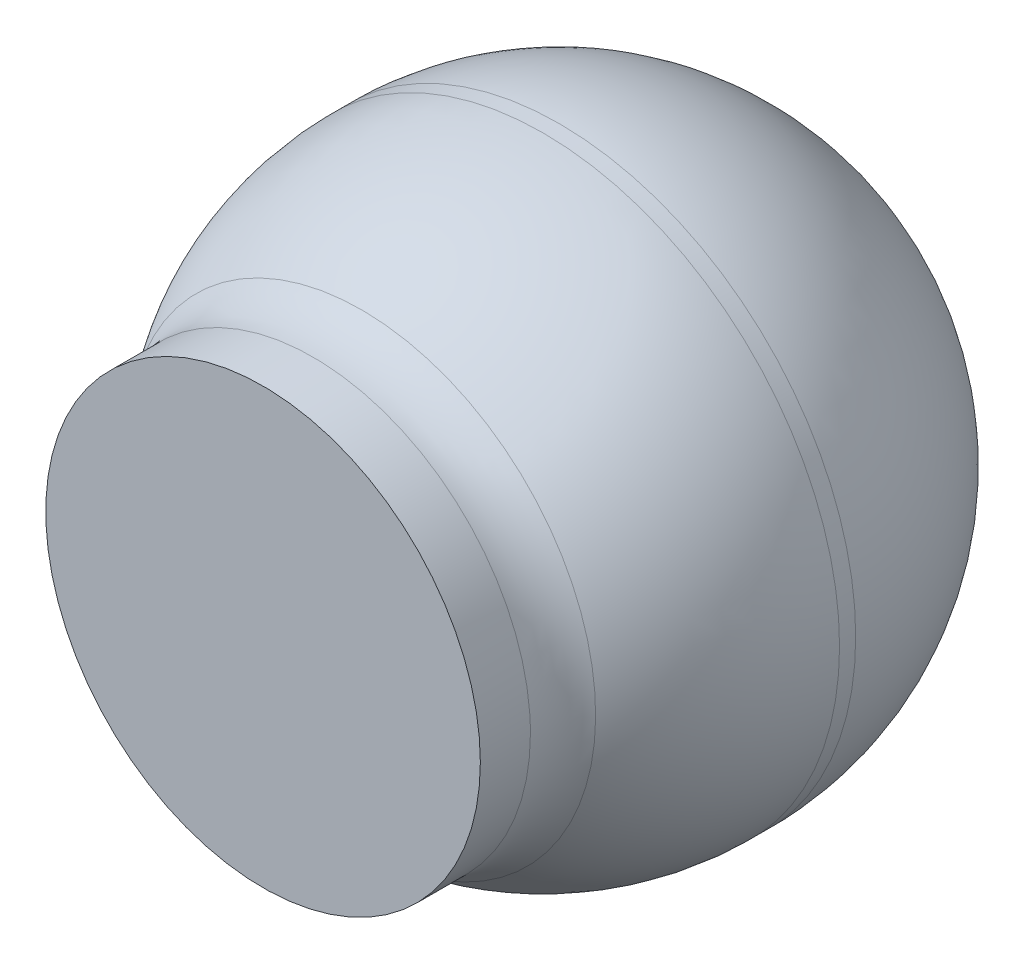
ISO-10303-21;
HEADER;
FILE_DESCRIPTION(('STEP AP214'),'2;1');
FILE_NAME('part.step','',(''),(''),'','','');
FILE_SCHEMA(('AUTOMOTIVE_DESIGN { 1 0 10303 214 1 1 1 1 }'));
ENDSEC;
DATA;
#1=APPLICATION_CONTEXT('core data for automotive mechanical design processes');
#2=APPLICATION_PROTOCOL_DEFINITION('international standard','automotive_design',2000,#1);
#3=PRODUCT_CONTEXT('',#1,'mechanical');
#4=PRODUCT('Part','Part','',(#3));
#5=PRODUCT_RELATED_PRODUCT_CATEGORY('part','',(#4));
#6=PRODUCT_DEFINITION_FORMATION('','',#4);
#7=PRODUCT_DEFINITION_CONTEXT('part definition',#1,'design');
#8=PRODUCT_DEFINITION('design','',#6,#7);
#9=PRODUCT_DEFINITION_SHAPE('','',#8);
#10=(LENGTH_UNIT() NAMED_UNIT(*) SI_UNIT(.MILLI.,.METRE.));
#11=(NAMED_UNIT(*) PLANE_ANGLE_UNIT() SI_UNIT($,.RADIAN.));
#12=(NAMED_UNIT(*) SI_UNIT($,.STERADIAN.) SOLID_ANGLE_UNIT());
#13=UNCERTAINTY_MEASURE_WITH_UNIT(LENGTH_MEASURE(1.E-05),#10,'distance_accuracy_value','');
#14=(GEOMETRIC_REPRESENTATION_CONTEXT(3) GLOBAL_UNCERTAINTY_ASSIGNED_CONTEXT((#13)) GLOBAL_UNIT_ASSIGNED_CONTEXT((#10,
#11,#12)) REPRESENTATION_CONTEXT('',''));
#15=CARTESIAN_POINT('',(0.,0.,0.));
#16=DIRECTION('',(0.,0.,1.));
#17=DIRECTION('',(1.,0.,0.));
#18=AXIS2_PLACEMENT_3D('',#15,#16,#17);
#19=CARTESIAN_POINT('',(0.707080077731,-2.781349291452,10.006534503384));
#20=DIRECTION('',(0.,0.,-1.));
#21=DIRECTION('',(-1.,0.,0.));
#22=AXIS2_PLACEMENT_3D('',#19,#20,#21);
#23=PLANE('',#22);
#24=CARTESIAN_POINT('',(0.707080077731,-2.781349291452,10.006534503384));
#25=DIRECTION('',(0.,0.,1.));
#26=DIRECTION('',(1.,0.,0.));
#27=AXIS2_PLACEMENT_3D('',#24,#25,#26);
#28=CIRCLE('',#27,0.275);
#29=CARTESIAN_POINT('',(0.982080077731,-2.781349291452,10.006534503384));
#30=VERTEX_POINT('',#29);
#31=EDGE_CURVE('E20',#30,#30,#28,.F.);
#32=ORIENTED_EDGE('',*,*,#31,.F.);
#33=EDGE_LOOP('',(#32));
#34=FACE_BOUND('',#33,.T.);
#35=ADVANCED_FACE('F17',(#34),#23,.F.);
#36=CARTESIAN_POINT('',(0.707080077731,-2.781349291452,9.906534503384));
#37=DIRECTION('',(0.,0.,1.));
#38=DIRECTION('',(1.,0.,0.));
#39=AXIS2_PLACEMENT_3D('',#36,#37,#38);
#40=CYLINDRICAL_SURFACE('',#39,0.275);
#41=CARTESIAN_POINT('',(0.707080077731,-2.781349291452,9.943180457728));
#42=DIRECTION('',(0.,0.,-1.));
#43=DIRECTION('',(0.996700902337583,0.0811622527992454,0.));
#44=AXIS2_PLACEMENT_3D('',#41,#42,#43);
#45=CIRCLE('',#44,0.275);
#46=CARTESIAN_POINT('',(0.981172825873835,-2.75902967193221,9.943180457728));
#47=VERTEX_POINT('',#46);
#48=EDGE_CURVE('E65',#47,#47,#45,.F.);
#49=ORIENTED_EDGE('',*,*,#48,.T.);
#50=EDGE_LOOP('',(#49));
#51=FACE_BOUND('',#50,.T.);
#52=ORIENTED_EDGE('',*,*,#31,.T.);
#53=EDGE_LOOP('',(#52));
#54=FACE_BOUND('',#53,.T.);
#55=ADVANCED_FACE('F62',(#51,#54),#40,.T.);
#56=CARTESIAN_POINT('',(0.707080077731,-2.781349291452,9.943180457728));
#57=DIRECTION('',(0.,0.,-1.));
#58=DIRECTION('',(0.996700902337583,0.081162252799246,0.));
#59=AXIS2_PLACEMENT_3D('',#56,#57,#58);
#60=TOROIDAL_SURFACE('',#59,0.375,0.1);
#61=ORIENTED_EDGE('',*,*,#48,.F.);
#62=EDGE_LOOP('',(#61));
#63=FACE_BOUND('',#62,.T.);
#64=CARTESIAN_POINT('',(0.707080077731001,-2.781349291452,9.881744931236));
#65=DIRECTION('',(0.,0.,-1.));
#66=DIRECTION('',(-0.996700902337598,-0.0811622527990607,0.));
#67=AXIS2_PLACEMENT_3D('',#64,#65,#66);
#68=CIRCLE('',#67,0.296097046412665);
#69=CARTESIAN_POINT('',(0.411959884392,-2.805381194786,9.881744931236));
#70=VERTEX_POINT('',#69);
#71=EDGE_CURVE('E39',#70,#70,#68,.T.);
#72=ORIENTED_EDGE('',*,*,#71,.F.);
#73=EDGE_LOOP('',(#72));
#74=FACE_BOUND('',#73,.T.);
#75=ADVANCED_FACE('F57',(#63,#74),#60,.F.);
#76=CARTESIAN_POINT('',(0.333317239355,-2.811785136252,9.651976062157));
#77=CARTESIAN_POINT('',(0.333317239355,-2.811785136252,9.701461392103));
#78=CARTESIAN_POINT('',(0.341473782652,-2.811120941579,9.750947004335));
#79=CARTESIAN_POINT('',(0.357792914651,-2.809792059952,9.798626332798));
#80=CARTESIAN_POINT('',(0.381658609162,-2.807848654938,9.842699544317));
#81=CARTESIAN_POINT('',(0.411959884392,-2.805381194786,9.881744931236));
#82=(BOUNDED_CURVE() B_SPLINE_CURVE(5,(#76,#77,#78,#79,#80,#81),.UNSPECIFIED.,.F.,
.F.) B_SPLINE_CURVE_WITH_KNOTS((6,6),(0.,0.661568582165),
.UNSPECIFIED.) CURVE() GEOMETRIC_REPRESENTATION_ITEM() RATIONAL_B_SPLINE_CURVE((1.,1.,1.,1.,1.,1.)) REPRESENTATION_ITEM(''));
#83=CARTESIAN_POINT('',(0.707080077731,-2.781349291452,9.651976062157));
#84=DIRECTION('',(0.,0.,-1.));
#85=AXIS1_PLACEMENT('',#83,#84);
#86=SURFACE_OF_REVOLUTION('',#82,#85);
#87=CARTESIAN_POINT('',(0.707080077731001,-2.781349291452,9.651976062157));
#88=DIRECTION('',(0.,0.,1.));
#89=DIRECTION('',(1.,0.,0.));
#90=AXIS2_PLACEMENT_3D('',#87,#88,#89);
#91=CIRCLE('',#90,0.375);
#92=CARTESIAN_POINT('',(1.082080077731,-2.781349291452,9.651976062157));
#93=VERTEX_POINT('',#92);
#94=EDGE_CURVE('E36',#93,#93,#91,.F.);
#95=ORIENTED_EDGE('',*,*,#94,.F.);
#96=EDGE_LOOP('',(#95));
#97=FACE_BOUND('',#96,.T.);
#98=ORIENTED_EDGE('',*,*,#71,.T.);
#99=EDGE_LOOP('',(#98));
#100=FACE_BOUND('',#99,.T.);
#101=ADVANCED_FACE('F53',(#97,#100),#86,.F.);
#102=CARTESIAN_POINT('',(0.707080077731,-2.781349291452,9.256534503384));
#103=DIRECTION('',(0.,0.,1.));
#104=DIRECTION('',(1.,0.,0.));
#105=AXIS2_PLACEMENT_3D('',#102,#103,#104);
#106=CYLINDRICAL_SURFACE('',#105,0.375);
#107=CARTESIAN_POINT('',(0.707080077731,-2.781349291452,9.631534503384));
#108=DIRECTION('',(0.,0.,-1.));
#109=DIRECTION('',(0.0811622527992361,-0.996700902337583,0.));
#110=AXIS2_PLACEMENT_3D('',#107,#108,#109);
#111=CIRCLE('',#110,0.375);
#112=CARTESIAN_POINT('',(0.737515922530713,-3.15511212982859,9.631534503384));
#113=VERTEX_POINT('',#112);
#114=CARTESIAN_POINT('',(0.676644232931287,-2.40758645307541,9.631534503384));
#115=VERTEX_POINT('',#114);
#116=EDGE_CURVE('E11',#113,#115,#111,.T.);
#117=ORIENTED_EDGE('',*,*,#116,.F.);
#118=CARTESIAN_POINT('',(0.707080077731,-2.781349291452,9.631534503384));
#119=DIRECTION('',(0.,0.,1.));
#120=DIRECTION('',(0.081162252799236,-0.996700902337583,0.));
#121=AXIS2_PLACEMENT_3D('',#118,#119,#120);
#122=CIRCLE('',#121,0.375);
#123=EDGE_CURVE('E25',#115,#113,#122,.F.);
#124=ORIENTED_EDGE('',*,*,#123,.F.);
#125=EDGE_LOOP('',(#117,#124));
#126=FACE_BOUND('',#125,.T.);
#127=ORIENTED_EDGE('',*,*,#94,.T.);
#128=EDGE_LOOP('',(#127));
#129=FACE_BOUND('',#128,.T.);
#130=ADVANCED_FACE('F34',(#126,#129),#106,.T.);
#131=CARTESIAN_POINT('',(0.707080077731,-2.781349291452,9.631534503384));
#132=DIRECTION('',(0.0811622527992361,-0.996700902337583,0.));
#133=DIRECTION('',(-0.996700902337583,-0.0811622527992361,0.));
#134=AXIS2_PLACEMENT_3D('',#131,#132,#133);
#135=SPHERICAL_SURFACE('',#134,0.375);
#136=ORIENTED_EDGE('',*,*,#123,.T.);
#137=ORIENTED_EDGE('',*,*,#116,.T.);
#138=EDGE_LOOP('',(#136,#137));
#139=FACE_BOUND('',#138,.T.);
#140=ADVANCED_FACE('F32',(#139),#135,.T.);
#141=CLOSED_SHELL('',(#35,#55,#75,#101,#130,#140));
#142=MANIFOLD_SOLID_BREP('B1',#141);
#143=ADVANCED_BREP_SHAPE_REPRESENTATION('',(#18,#142),#14);
#144=SHAPE_DEFINITION_REPRESENTATION(#9,#143);
ENDSEC;
END-ISO-10303-21;
